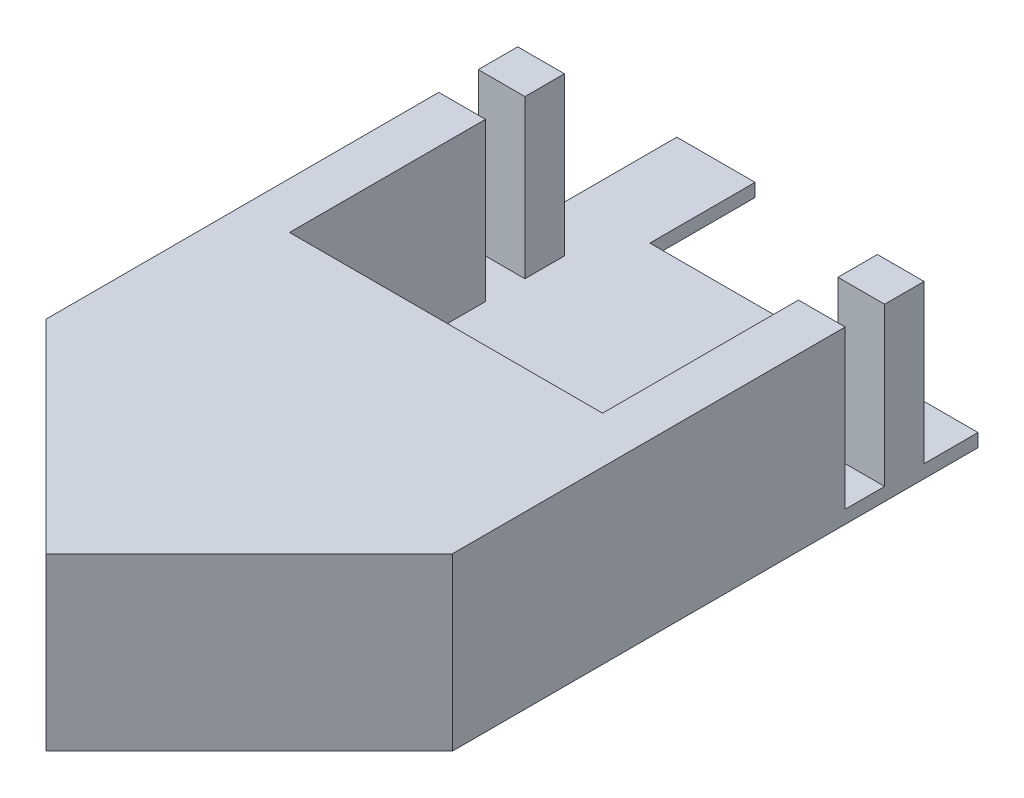
ISO-10303-21;
HEADER;
FILE_DESCRIPTION(('STEP AP214'),'2;1');
FILE_NAME('part.step','',(''),(''),'','','');
FILE_SCHEMA(('AUTOMOTIVE_DESIGN { 1 0 10303 214 1 1 1 1 }'));
ENDSEC;
DATA;
#1=APPLICATION_CONTEXT('core data for automotive mechanical design processes');
#2=APPLICATION_PROTOCOL_DEFINITION('international standard','automotive_design',2000,#1);
#3=PRODUCT_CONTEXT('',#1,'mechanical');
#4=PRODUCT('Part','Part','',(#3));
#5=PRODUCT_RELATED_PRODUCT_CATEGORY('part','',(#4));
#6=PRODUCT_DEFINITION_FORMATION('','',#4);
#7=PRODUCT_DEFINITION_CONTEXT('part definition',#1,'design');
#8=PRODUCT_DEFINITION('design','',#6,#7);
#9=PRODUCT_DEFINITION_SHAPE('','',#8);
#10=(LENGTH_UNIT() NAMED_UNIT(*) SI_UNIT(.MILLI.,.METRE.));
#11=(NAMED_UNIT(*) PLANE_ANGLE_UNIT() SI_UNIT($,.RADIAN.));
#12=(NAMED_UNIT(*) SI_UNIT($,.STERADIAN.) SOLID_ANGLE_UNIT());
#13=UNCERTAINTY_MEASURE_WITH_UNIT(LENGTH_MEASURE(1.E-05),#10,'distance_accuracy_value','');
#14=(GEOMETRIC_REPRESENTATION_CONTEXT(3) GLOBAL_UNCERTAINTY_ASSIGNED_CONTEXT((#13)) GLOBAL_UNIT_ASSIGNED_CONTEXT((#10,
#11,#12)) REPRESENTATION_CONTEXT('',''));
#15=CARTESIAN_POINT('',(0.,0.,0.));
#16=DIRECTION('',(0.,0.,1.));
#17=DIRECTION('',(1.,0.,0.));
#18=AXIS2_PLACEMENT_3D('',#15,#16,#17);
#19=CARTESIAN_POINT('',(0.,-13.1177892367924,0.));
#20=DIRECTION('',(0.,1.,0.));
#21=DIRECTION('',(0.,0.,1.));
#22=AXIS2_PLACEMENT_3D('',#19,#20,#21);
#23=PLANE('',#22);
#24=DIRECTION('',(0.,0.,1.));
#25=VECTOR('',#24,1.);
#26=CARTESIAN_POINT('',(86.384314575051,-13.1177892367924,0.));
#27=LINE('',#26,#25);
#28=CARTESIAN_POINT('',(86.384314575051,-13.1177892367924,-75.9843145750497));
#29=VERTEX_POINT('',#28);
#30=CARTESIAN_POINT('',(86.384314575051,-13.1177892367924,-71.8843145750497));
#31=VERTEX_POINT('',#30);
#32=EDGE_CURVE('E207',#29,#31,#27,.T.);
#33=ORIENTED_EDGE('',*,*,#32,.F.);
#34=DIRECTION('',(-1.,0.,0.));
#35=VECTOR('',#34,1.);
#36=CARTESIAN_POINT('',(0.,-13.1177892367924,-75.9843145750497));
#37=LINE('',#36,#35);
#38=CARTESIAN_POINT('',(61.434314575053,-13.1177892367924,-75.9843145750497));
#39=VERTEX_POINT('',#38);
#40=EDGE_CURVE('E199',#29,#39,#37,.T.);
#41=ORIENTED_EDGE('',*,*,#40,.T.);
#42=DIRECTION('',(0.,0.,-1.));
#43=VECTOR('',#42,1.);
#44=CARTESIAN_POINT('',(61.434314575053,-13.1177892367924,0.));
#45=LINE('',#44,#43);
#46=CARTESIAN_POINT('',(61.434314575053,-13.1177892367924,-83.9843145750501));
#47=VERTEX_POINT('',#46);
#48=EDGE_CURVE('E186',#39,#47,#45,.T.);
#49=ORIENTED_EDGE('',*,*,#48,.T.);
#50=DIRECTION('',(1.,0.,0.));
#51=VECTOR('',#50,1.);
#52=CARTESIAN_POINT('',(-5.43153318923716E-12,-13.1177892367924,-83.9843145750461));
#53=LINE('',#52,#51);
#54=CARTESIAN_POINT('',(55.4843145750486,-13.1177892367924,-83.9843145750497));
#55=VERTEX_POINT('',#54);
#56=EDGE_CURVE('E198',#55,#47,#53,.T.);
#57=ORIENTED_EDGE('',*,*,#56,.F.);
#58=DIRECTION('',(0.,0.,1.));
#59=VECTOR('',#58,1.);
#60=CARTESIAN_POINT('',(55.4843145750486,-13.1177892367924,0.));
#61=LINE('',#60,#59);
#62=CARTESIAN_POINT('',(55.4843145750486,-13.1177892367924,-71.8843145750497));
#63=VERTEX_POINT('',#62);
#64=EDGE_CURVE('E211',#55,#63,#61,.T.);
#65=ORIENTED_EDGE('',*,*,#64,.T.);
#66=DIRECTION('',(-1.,0.,0.));
#67=VECTOR('',#66,1.);
#68=CARTESIAN_POINT('',(0.,-13.1177892367924,-71.8843145750497));
#69=LINE('',#68,#67);
#70=CARTESIAN_POINT('',(59.0343145750498,-13.1177892367924,-71.8843145750497));
#71=VERTEX_POINT('',#70);
#72=EDGE_CURVE('E391',#71,#63,#69,.T.);
#73=ORIENTED_EDGE('',*,*,#72,.F.);
#74=DIRECTION('',(0.,0.,-1.));
#75=VECTOR('',#74,1.);
#76=CARTESIAN_POINT('',(59.0343145750498,-13.1177892367924,0.));
#77=LINE('',#76,#75);
#78=CARTESIAN_POINT('',(59.0343145750498,-13.1177892367924,-68.8843145750497));
#79=VERTEX_POINT('',#78);
#80=EDGE_CURVE('E64',#79,#71,#77,.T.);
#81=ORIENTED_EDGE('',*,*,#80,.F.);
#82=DIRECTION('',(1.,0.,0.));
#83=VECTOR('',#82,1.);
#84=CARTESIAN_POINT('',(0.,-13.1177892367924,-68.8843145750497));
#85=LINE('',#84,#83);
#86=CARTESIAN_POINT('',(55.4843145750486,-13.1177892367924,-68.8843145750497));
#87=VERTEX_POINT('',#86);
#88=EDGE_CURVE('E360',#87,#79,#85,.T.);
#89=ORIENTED_EDGE('',*,*,#88,.F.);
#90=CARTESIAN_POINT('',(55.4843145750486,-13.1177892367924,-65.8843145750497));
#91=VERTEX_POINT('',#90);
#92=EDGE_CURVE('E206',#87,#91,#61,.T.);
#93=ORIENTED_EDGE('',*,*,#92,.T.);
#94=DIRECTION('',(-1.,0.,0.));
#95=VECTOR('',#94,1.);
#96=CARTESIAN_POINT('',(0.,-13.1177892367924,-65.8843145750497));
#97=LINE('',#96,#95);
#98=CARTESIAN_POINT('',(59.0343145750498,-13.1177892367924,-65.8843145750497));
#99=VERTEX_POINT('',#98);
#100=EDGE_CURVE('E305',#99,#91,#97,.T.);
#101=ORIENTED_EDGE('',*,*,#100,.F.);
#102=DIRECTION('',(0.,0.,-1.));
#103=VECTOR('',#102,1.);
#104=CARTESIAN_POINT('',(59.0343145750498,-13.1177892367924,0.));
#105=LINE('',#104,#103);
#106=CARTESIAN_POINT('',(59.0343145750498,-13.1177892367924,-50.9843145750497));
#107=VERTEX_POINT('',#106);
#108=EDGE_CURVE('E309',#107,#99,#105,.T.);
#109=ORIENTED_EDGE('',*,*,#108,.F.);
#110=DIRECTION('',(-1.,0.,0.));
#111=VECTOR('',#110,1.);
#112=CARTESIAN_POINT('',(0.,-13.1177892367924,-50.9843145750497));
#113=LINE('',#112,#111);
#114=CARTESIAN_POINT('',(82.8343145750498,-13.1177892367924,-50.9843145750497));
#115=VERTEX_POINT('',#114);
#116=EDGE_CURVE('E312',#115,#107,#113,.T.);
#117=ORIENTED_EDGE('',*,*,#116,.F.);
#118=DIRECTION('',(0.,0.,1.));
#119=VECTOR('',#118,1.);
#120=CARTESIAN_POINT('',(82.8343145750498,-13.1177892367924,0.));
#121=LINE('',#120,#119);
#122=CARTESIAN_POINT('',(82.8343145750498,-13.1177892367924,-65.8843145750497));
#123=VERTEX_POINT('',#122);
#124=EDGE_CURVE('E315',#123,#115,#121,.T.);
#125=ORIENTED_EDGE('',*,*,#124,.F.);
#126=DIRECTION('',(-1.,0.,0.));
#127=VECTOR('',#126,1.);
#128=CARTESIAN_POINT('',(0.,-13.1177892367924,-65.8843145750497));
#129=LINE('',#128,#127);
#130=CARTESIAN_POINT('',(86.384314575051,-13.1177892367924,-65.8843145750497));
#131=VERTEX_POINT('',#130);
#132=EDGE_CURVE('E223',#131,#123,#129,.T.);
#133=ORIENTED_EDGE('',*,*,#132,.F.);
#134=CARTESIAN_POINT('',(86.384314575051,-13.1177892367924,-68.8843145750497));
#135=VERTEX_POINT('',#134);
#136=EDGE_CURVE('E213',#135,#131,#27,.T.);
#137=ORIENTED_EDGE('',*,*,#136,.F.);
#138=DIRECTION('',(-1.,0.,0.));
#139=VECTOR('',#138,1.);
#140=CARTESIAN_POINT('',(0.,-13.1177892367924,-68.8843145750497));
#141=LINE('',#140,#139);
#142=CARTESIAN_POINT('',(82.8343145750498,-13.1177892367924,-68.8843145750497));
#143=VERTEX_POINT('',#142);
#144=EDGE_CURVE('E430',#135,#143,#141,.T.);
#145=ORIENTED_EDGE('',*,*,#144,.T.);
#146=DIRECTION('',(0.,0.,-1.));
#147=VECTOR('',#146,1.);
#148=CARTESIAN_POINT('',(82.8343145750498,-13.1177892367924,0.));
#149=LINE('',#148,#147);
#150=CARTESIAN_POINT('',(82.8343145750498,-13.1177892367924,-71.8843145750497));
#151=VERTEX_POINT('',#150);
#152=EDGE_CURVE('E434',#143,#151,#149,.T.);
#153=ORIENTED_EDGE('',*,*,#152,.T.);
#154=DIRECTION('',(1.,0.,0.));
#155=VECTOR('',#154,1.);
#156=CARTESIAN_POINT('',(0.,-13.1177892367924,-71.8843145750497));
#157=LINE('',#156,#155);
#158=EDGE_CURVE('E426',#151,#31,#157,.T.);
#159=ORIENTED_EDGE('',*,*,#158,.T.);
#160=EDGE_LOOP('',(#33,#41,#49,#57,#65,#73,#81,#89,#93,#101,#109,#117,#125,#133,#137,#145,#153,#159));
#161=FACE_BOUND('',#160,.T.);
#162=ADVANCED_FACE('F41',(#161),#23,.T.);
#163=CARTESIAN_POINT('',(86.384314575051,-13.1177892367924,0.));
#164=DIRECTION('',(1.,0.,0.));
#165=DIRECTION('',(0.,0.,-1.));
#166=AXIS2_PLACEMENT_3D('',#163,#164,#165);
#167=PLANE('',#166);
#168=DIRECTION('',(0.,0.,1.));
#169=VECTOR('',#168,1.);
#170=CARTESIAN_POINT('',(86.384314575051,-14.1177892367924,0.));
#171=LINE('',#170,#169);
#172=CARTESIAN_POINT('',(86.384314575051,-14.1177892367924,-75.9843145750497));
#173=VERTEX_POINT('',#172);
#174=CARTESIAN_POINT('',(86.384314575051,-14.1177892367924,-36.0156854249524));
#175=VERTEX_POINT('',#174);
#176=EDGE_CURVE('E219',#173,#175,#171,.T.);
#177=ORIENTED_EDGE('',*,*,#176,.F.);
#178=DIRECTION('',(0.,-1.,0.));
#179=VECTOR('',#178,1.);
#180=CARTESIAN_POINT('',(86.384314575051,19.4077915204273,-75.9843145750497));
#181=LINE('',#180,#179);
#182=EDGE_CURVE('E193',#29,#173,#181,.T.);
#183=ORIENTED_EDGE('',*,*,#182,.F.);
#184=ORIENTED_EDGE('',*,*,#32,.T.);
#185=DIRECTION('',(0.,-1.,0.));
#186=VECTOR('',#185,1.);
#187=CARTESIAN_POINT('',(86.384314575051,-1.11778923679241,-71.8843145750497));
#188=LINE('',#187,#186);
#189=CARTESIAN_POINT('',(86.384314575051,-1.11778923679241,-71.8843145750497));
#190=VERTEX_POINT('',#189);
#191=EDGE_CURVE('E414',#190,#31,#188,.T.);
#192=ORIENTED_EDGE('',*,*,#191,.F.);
#193=DIRECTION('',(0.,0.,1.));
#194=VECTOR('',#193,1.);
#195=CARTESIAN_POINT('',(86.384314575051,-1.11778923679241,0.));
#196=LINE('',#195,#194);
#197=CARTESIAN_POINT('',(86.384314575051,-1.11778923679241,-68.8843145750497));
#198=VERTEX_POINT('',#197);
#199=EDGE_CURVE('E403',#190,#198,#196,.T.);
#200=ORIENTED_EDGE('',*,*,#199,.T.);
#201=DIRECTION('',(0.,-1.,0.));
#202=VECTOR('',#201,1.);
#203=CARTESIAN_POINT('',(86.384314575051,-1.11778923679241,-68.8843145750497));
#204=LINE('',#203,#202);
#205=EDGE_CURVE('E418',#198,#135,#204,.T.);
#206=ORIENTED_EDGE('',*,*,#205,.T.);
#207=ORIENTED_EDGE('',*,*,#136,.T.);
#208=DIRECTION('',(0.,-1.,0.));
#209=VECTOR('',#208,1.);
#210=CARTESIAN_POINT('',(86.384314575051,-1.11778923679241,-65.8843145750497));
#211=LINE('',#210,#209);
#212=CARTESIAN_POINT('',(86.384314575051,-1.11778923679241,-65.8843145750497));
#213=VERTEX_POINT('',#212);
#214=EDGE_CURVE('E276',#213,#131,#211,.T.);
#215=ORIENTED_EDGE('',*,*,#214,.F.);
#216=DIRECTION('',(0.,0.,1.));
#217=VECTOR('',#216,1.);
#218=CARTESIAN_POINT('',(86.384314575051,-1.11778923679241,0.));
#219=LINE('',#218,#217);
#220=CARTESIAN_POINT('',(86.384314575051,-1.11778923679241,-36.0156854249524));
#221=VERTEX_POINT('',#220);
#222=EDGE_CURVE('E271',#213,#221,#219,.T.);
#223=ORIENTED_EDGE('',*,*,#222,.T.);
#224=DIRECTION('',(0.,-1.,0.));
#225=VECTOR('',#224,1.);
#226=CARTESIAN_POINT('',(86.384314575051,-13.1177892367924,-36.0156854249524));
#227=LINE('',#226,#225);
#228=EDGE_CURVE('E218',#221,#175,#227,.T.);
#229=ORIENTED_EDGE('',*,*,#228,.T.);
#230=EDGE_LOOP('',(#177,#183,#184,#192,#200,#206,#207,#215,#223,#229));
#231=FACE_BOUND('',#230,.T.);
#232=ADVANCED_FACE('F43',(#231),#167,.T.);
#233=CARTESIAN_POINT('',(-5.43153318923716E-12,-13.1177892367924,-83.9843145750461));
#234=DIRECTION('',(0.,0.,-1.));
#235=DIRECTION('',(-1.,0.,0.));
#236=AXIS2_PLACEMENT_3D('',#233,#234,#235);
#237=PLANE('',#236);
#238=ORIENTED_EDGE('',*,*,#56,.T.);
#239=DIRECTION('',(0.,-1.,0.));
#240=VECTOR('',#239,1.);
#241=CARTESIAN_POINT('',(61.434314575053,19.4077915204273,-83.9843145750501));
#242=LINE('',#241,#240);
#243=CARTESIAN_POINT('',(61.434314575053,-14.1177892367924,-83.9843145750501));
#244=VERTEX_POINT('',#243);
#245=EDGE_CURVE('E183',#47,#244,#242,.T.);
#246=ORIENTED_EDGE('',*,*,#245,.T.);
#247=DIRECTION('',(1.,0.,0.));
#248=VECTOR('',#247,1.);
#249=CARTESIAN_POINT('',(-5.43153318923716E-12,-14.1177892367924,-83.9843145750461));
#250=LINE('',#249,#248);
#251=CARTESIAN_POINT('',(55.4843145750486,-14.1177892367924,-83.9843145750497));
#252=VERTEX_POINT('',#251);
#253=EDGE_CURVE('E222',#252,#244,#250,.T.);
#254=ORIENTED_EDGE('',*,*,#253,.F.);
#255=DIRECTION('',(0.,-1.,0.));
#256=VECTOR('',#255,1.);
#257=CARTESIAN_POINT('',(55.4843145750486,-13.1177892367924,-83.9843145750497));
#258=LINE('',#257,#256);
#259=EDGE_CURVE('E203',#55,#252,#258,.T.);
#260=ORIENTED_EDGE('',*,*,#259,.F.);
#261=EDGE_LOOP('',(#238,#246,#254,#260));
#262=FACE_BOUND('',#261,.T.);
#263=ADVANCED_FACE('F202',(#262),#237,.T.);
#264=CARTESIAN_POINT('',(0.,-14.1177892367924,0.));
#265=DIRECTION('',(0.,1.,0.));
#266=DIRECTION('',(0.,0.,1.));
#267=AXIS2_PLACEMENT_3D('',#264,#265,#266);
#268=PLANE('',#267);
#269=DIRECTION('',(-1.,0.,0.));
#270=VECTOR('',#269,1.);
#271=CARTESIAN_POINT('',(0.,-14.1177892367924,-75.9843145750497));
#272=LINE('',#271,#270);
#273=CARTESIAN_POINT('',(61.434314575053,-14.1177892367924,-75.9843145750497));
#274=VERTEX_POINT('',#273);
#275=EDGE_CURVE('E11',#173,#274,#272,.T.);
#276=ORIENTED_EDGE('',*,*,#275,.F.);
#277=ORIENTED_EDGE('',*,*,#176,.T.);
#278=DIRECTION('',(0.707106781186547,0.,-0.707106781186548));
#279=VECTOR('',#278,1.);
#280=CARTESIAN_POINT('',(25.1843145750493,-14.1177892367924,25.1843145750493));
#281=LINE('',#280,#279);
#282=CARTESIAN_POINT('',(70.9343145750498,-14.1177892367924,-20.5656854249512));
#283=VERTEX_POINT('',#282);
#284=EDGE_CURVE('E232',#283,#175,#281,.T.);
#285=ORIENTED_EDGE('',*,*,#284,.F.);
#286=DIRECTION('',(0.707106781186547,0.,0.707106781186548));
#287=VECTOR('',#286,1.);
#288=CARTESIAN_POINT('',(45.7500000000005,-14.1177892367924,-45.7500000000005));
#289=LINE('',#288,#287);
#290=CARTESIAN_POINT('',(55.4843145750486,-14.1177892367924,-36.0156854249524));
#291=VERTEX_POINT('',#290);
#292=EDGE_CURVE('E229',#291,#283,#289,.T.);
#293=ORIENTED_EDGE('',*,*,#292,.F.);
#294=DIRECTION('',(0.,0.,1.));
#295=VECTOR('',#294,1.);
#296=CARTESIAN_POINT('',(55.4843145750486,-14.1177892367924,0.));
#297=LINE('',#296,#295);
#298=EDGE_CURVE('E226',#252,#291,#297,.T.);
#299=ORIENTED_EDGE('',*,*,#298,.F.);
#300=ORIENTED_EDGE('',*,*,#253,.T.);
#301=DIRECTION('',(0.,0.,-1.));
#302=VECTOR('',#301,1.);
#303=CARTESIAN_POINT('',(61.434314575053,-14.1177892367924,0.));
#304=LINE('',#303,#302);
#305=EDGE_CURVE('E50',#274,#244,#304,.T.);
#306=ORIENTED_EDGE('',*,*,#305,.F.);
#307=EDGE_LOOP('',(#276,#277,#285,#293,#299,#300,#306));
#308=FACE_BOUND('',#307,.T.);
#309=ADVANCED_FACE('F256',(#308),#268,.F.);
#310=CARTESIAN_POINT('',(55.4843145750486,-13.1177892367924,0.));
#311=DIRECTION('',(1.,0.,0.));
#312=DIRECTION('',(0.,0.,-1.));
#313=AXIS2_PLACEMENT_3D('',#310,#311,#312);
#314=PLANE('',#313);
#315=ORIENTED_EDGE('',*,*,#298,.T.);
#316=DIRECTION('',(0.,-1.,0.));
#317=VECTOR('',#316,1.);
#318=CARTESIAN_POINT('',(55.4843145750486,-13.1177892367924,-36.0156854249524));
#319=LINE('',#318,#317);
#320=CARTESIAN_POINT('',(55.4843145750486,-1.11778923679241,-36.0156854249524));
#321=VERTEX_POINT('',#320);
#322=EDGE_CURVE('E243',#321,#291,#319,.T.);
#323=ORIENTED_EDGE('',*,*,#322,.F.);
#324=DIRECTION('',(0.,0.,1.));
#325=VECTOR('',#324,1.);
#326=CARTESIAN_POINT('',(55.4843145750486,-1.11778923679241,0.));
#327=LINE('',#326,#325);
#328=CARTESIAN_POINT('',(55.4843145750486,-1.11778923679241,-65.8843145750497));
#329=VERTEX_POINT('',#328);
#330=EDGE_CURVE('E278',#329,#321,#327,.T.);
#331=ORIENTED_EDGE('',*,*,#330,.F.);
#332=DIRECTION('',(0.,-1.,0.));
#333=VECTOR('',#332,1.);
#334=CARTESIAN_POINT('',(55.4843145750486,-1.11778923679241,-65.8843145750497));
#335=LINE('',#334,#333);
#336=EDGE_CURVE('E285',#329,#91,#335,.T.);
#337=ORIENTED_EDGE('',*,*,#336,.T.);
#338=ORIENTED_EDGE('',*,*,#92,.F.);
#339=DIRECTION('',(0.,-1.,0.));
#340=VECTOR('',#339,1.);
#341=CARTESIAN_POINT('',(55.4843145750486,-1.11778923679241,-68.8843145750497));
#342=LINE('',#341,#340);
#343=CARTESIAN_POINT('',(55.4843145750486,-1.11778923679241,-68.8843145750497));
#344=VERTEX_POINT('',#343);
#345=EDGE_CURVE('E368',#344,#87,#342,.T.);
#346=ORIENTED_EDGE('',*,*,#345,.F.);
#347=DIRECTION('',(0.,0.,1.));
#348=VECTOR('',#347,1.);
#349=CARTESIAN_POINT('',(55.4843145750486,-1.11778923679241,0.));
#350=LINE('',#349,#348);
#351=CARTESIAN_POINT('',(55.4843145750486,-1.11778923679241,-71.8843145750497));
#352=VERTEX_POINT('',#351);
#353=EDGE_CURVE('E375',#352,#344,#350,.T.);
#354=ORIENTED_EDGE('',*,*,#353,.F.);
#355=DIRECTION('',(0.,-1.,0.));
#356=VECTOR('',#355,1.);
#357=CARTESIAN_POINT('',(55.4843145750486,-1.11778923679241,-71.8843145750497));
#358=LINE('',#357,#356);
#359=EDGE_CURVE('E374',#352,#63,#358,.T.);
#360=ORIENTED_EDGE('',*,*,#359,.T.);
#361=ORIENTED_EDGE('',*,*,#64,.F.);
#362=ORIENTED_EDGE('',*,*,#259,.T.);
#363=EDGE_LOOP('',(#315,#323,#331,#337,#338,#346,#354,#360,#361,#362));
#364=FACE_BOUND('',#363,.T.);
#365=ADVANCED_FACE('F251',(#364),#314,.F.);
#366=CARTESIAN_POINT('',(45.7500000000005,-13.1177892367924,-45.7500000000005));
#367=DIRECTION('',(0.707106781186548,0.,-0.707106781186547));
#368=DIRECTION('',(-0.707106781186547,0.,-0.707106781186548));
#369=AXIS2_PLACEMENT_3D('',#366,#367,#368);
#370=PLANE('',#369);
#371=ORIENTED_EDGE('',*,*,#292,.T.);
#372=DIRECTION('',(0.,-1.,0.));
#373=VECTOR('',#372,1.);
#374=CARTESIAN_POINT('',(70.9343145750498,-13.1177892367924,-20.5656854249512));
#375=LINE('',#374,#373);
#376=CARTESIAN_POINT('',(70.9343145750498,-1.11778923679241,-20.5656854249512));
#377=VERTEX_POINT('',#376);
#378=EDGE_CURVE('E239',#377,#283,#375,.T.);
#379=ORIENTED_EDGE('',*,*,#378,.F.);
#380=DIRECTION('',(0.707106781186547,0.,0.707106781186548));
#381=VECTOR('',#380,1.);
#382=CARTESIAN_POINT('',(45.7500000000005,-1.11778923679241,-45.7500000000005));
#383=LINE('',#382,#381);
#384=EDGE_CURVE('E272',#321,#377,#383,.T.);
#385=ORIENTED_EDGE('',*,*,#384,.F.);
#386=ORIENTED_EDGE('',*,*,#322,.T.);
#387=EDGE_LOOP('',(#371,#379,#385,#386));
#388=FACE_BOUND('',#387,.T.);
#389=ADVANCED_FACE('F259',(#388),#370,.F.);
#390=CARTESIAN_POINT('',(25.1843145750493,-13.1177892367924,25.1843145750493));
#391=DIRECTION('',(-0.707106781186548,0.,-0.707106781186547));
#392=DIRECTION('',(-0.707106781186547,0.,0.707106781186548));
#393=AXIS2_PLACEMENT_3D('',#390,#391,#392);
#394=PLANE('',#393);
#395=ORIENTED_EDGE('',*,*,#284,.T.);
#396=ORIENTED_EDGE('',*,*,#228,.F.);
#397=DIRECTION('',(0.707106781186547,0.,-0.707106781186548));
#398=VECTOR('',#397,1.);
#399=CARTESIAN_POINT('',(25.1843145750493,-1.11778923679241,25.1843145750493));
#400=LINE('',#399,#398);
#401=EDGE_CURVE('E266',#377,#221,#400,.T.);
#402=ORIENTED_EDGE('',*,*,#401,.F.);
#403=ORIENTED_EDGE('',*,*,#378,.T.);
#404=EDGE_LOOP('',(#395,#396,#402,#403));
#405=FACE_BOUND('',#404,.T.);
#406=ADVANCED_FACE('F264',(#405),#394,.F.);
#407=CARTESIAN_POINT('',(0.,-1.11778923679241,-65.8843145750497));
#408=DIRECTION('',(0.,0.,-1.));
#409=DIRECTION('',(-1.,0.,0.));
#410=AXIS2_PLACEMENT_3D('',#407,#408,#409);
#411=PLANE('',#410);
#412=ORIENTED_EDGE('',*,*,#214,.T.);
#413=ORIENTED_EDGE('',*,*,#132,.T.);
#414=DIRECTION('',(0.,-1.,0.));
#415=VECTOR('',#414,1.);
#416=CARTESIAN_POINT('',(82.8343145750498,-1.11778923679241,-65.8843145750497));
#417=LINE('',#416,#415);
#418=CARTESIAN_POINT('',(82.8343145750498,-1.11778923679241,-65.8843145750497));
#419=VERTEX_POINT('',#418);
#420=EDGE_CURVE('E301',#419,#123,#417,.T.);
#421=ORIENTED_EDGE('',*,*,#420,.F.);
#422=DIRECTION('',(1.,0.,0.));
#423=VECTOR('',#422,1.);
#424=CARTESIAN_POINT('',(0.,-1.11778923679241,-65.8843145750497));
#425=LINE('',#424,#423);
#426=EDGE_CURVE('E438',#419,#213,#425,.T.);
#427=ORIENTED_EDGE('',*,*,#426,.T.);
#428=EDGE_LOOP('',(#412,#413,#421,#427));
#429=FACE_BOUND('',#428,.T.);
#430=ADVANCED_FACE('F320',(#429),#411,.T.);
#431=CARTESIAN_POINT('',(82.8343145750498,-1.11778923679241,0.));
#432=DIRECTION('',(-1.,0.,0.));
#433=DIRECTION('',(0.,0.,1.));
#434=AXIS2_PLACEMENT_3D('',#431,#432,#433);
#435=PLANE('',#434);
#436=ORIENTED_EDGE('',*,*,#420,.T.);
#437=ORIENTED_EDGE('',*,*,#124,.T.);
#438=DIRECTION('',(0.,-1.,0.));
#439=VECTOR('',#438,1.);
#440=CARTESIAN_POINT('',(82.8343145750498,-1.11778923679241,-50.9843145750497));
#441=LINE('',#440,#439);
#442=CARTESIAN_POINT('',(82.8343145750498,-1.11778923679241,-50.9843145750497));
#443=VERTEX_POINT('',#442);
#444=EDGE_CURVE('E297',#443,#115,#441,.T.);
#445=ORIENTED_EDGE('',*,*,#444,.F.);
#446=DIRECTION('',(0.,0.,-1.));
#447=VECTOR('',#446,1.);
#448=CARTESIAN_POINT('',(82.8343145750498,-1.11778923679241,0.));
#449=LINE('',#448,#447);
#450=EDGE_CURVE('E329',#443,#419,#449,.T.);
#451=ORIENTED_EDGE('',*,*,#450,.T.);
#452=EDGE_LOOP('',(#436,#437,#445,#451));
#453=FACE_BOUND('',#452,.T.);
#454=ADVANCED_FACE('F327',(#453),#435,.T.);
#455=CARTESIAN_POINT('',(0.,-1.11778923679241,-50.9843145750497));
#456=DIRECTION('',(0.,0.,-1.));
#457=DIRECTION('',(-1.,0.,0.));
#458=AXIS2_PLACEMENT_3D('',#455,#456,#457);
#459=PLANE('',#458);
#460=ORIENTED_EDGE('',*,*,#444,.T.);
#461=ORIENTED_EDGE('',*,*,#116,.T.);
#462=DIRECTION('',(0.,-1.,0.));
#463=VECTOR('',#462,1.);
#464=CARTESIAN_POINT('',(59.0343145750498,-1.11778923679241,-50.9843145750497));
#465=LINE('',#464,#463);
#466=CARTESIAN_POINT('',(59.0343145750498,-1.11778923679241,-50.9843145750497));
#467=VERTEX_POINT('',#466);
#468=EDGE_CURVE('E293',#467,#107,#465,.T.);
#469=ORIENTED_EDGE('',*,*,#468,.F.);
#470=DIRECTION('',(1.,0.,0.));
#471=VECTOR('',#470,1.);
#472=CARTESIAN_POINT('',(0.,-1.11778923679241,-50.9843145750497));
#473=LINE('',#472,#471);
#474=EDGE_CURVE('E346',#467,#443,#473,.T.);
#475=ORIENTED_EDGE('',*,*,#474,.T.);
#476=EDGE_LOOP('',(#460,#461,#469,#475));
#477=FACE_BOUND('',#476,.T.);
#478=ADVANCED_FACE('F334',(#477),#459,.T.);
#479=CARTESIAN_POINT('',(59.0343145750498,-1.11778923679241,0.));
#480=DIRECTION('',(1.,0.,0.));
#481=DIRECTION('',(0.,0.,-1.));
#482=AXIS2_PLACEMENT_3D('',#479,#480,#481);
#483=PLANE('',#482);
#484=ORIENTED_EDGE('',*,*,#468,.T.);
#485=ORIENTED_EDGE('',*,*,#108,.T.);
#486=DIRECTION('',(0.,-1.,0.));
#487=VECTOR('',#486,1.);
#488=CARTESIAN_POINT('',(59.0343145750498,-1.11778923679241,-65.8843145750497));
#489=LINE('',#488,#487);
#490=CARTESIAN_POINT('',(59.0343145750498,-1.11778923679241,-65.8843145750497));
#491=VERTEX_POINT('',#490);
#492=EDGE_CURVE('E289',#491,#99,#489,.T.);
#493=ORIENTED_EDGE('',*,*,#492,.F.);
#494=DIRECTION('',(0.,0.,1.));
#495=VECTOR('',#494,1.);
#496=CARTESIAN_POINT('',(59.0343145750498,-1.11778923679241,0.));
#497=LINE('',#496,#495);
#498=EDGE_CURVE('E341',#491,#467,#497,.T.);
#499=ORIENTED_EDGE('',*,*,#498,.T.);
#500=EDGE_LOOP('',(#484,#485,#493,#499));
#501=FACE_BOUND('',#500,.T.);
#502=ADVANCED_FACE('F339',(#501),#483,.T.);
#503=CARTESIAN_POINT('',(0.,-1.11778923679241,-65.8843145750497));
#504=DIRECTION('',(0.,0.,-1.));
#505=DIRECTION('',(-1.,0.,0.));
#506=AXIS2_PLACEMENT_3D('',#503,#504,#505);
#507=PLANE('',#506);
#508=ORIENTED_EDGE('',*,*,#492,.T.);
#509=ORIENTED_EDGE('',*,*,#100,.T.);
#510=ORIENTED_EDGE('',*,*,#336,.F.);
#511=DIRECTION('',(1.,0.,0.));
#512=VECTOR('',#511,1.);
#513=CARTESIAN_POINT('',(0.,-1.11778923679241,-65.8843145750497));
#514=LINE('',#513,#512);
#515=EDGE_CURVE('E345',#329,#491,#514,.T.);
#516=ORIENTED_EDGE('',*,*,#515,.T.);
#517=EDGE_LOOP('',(#508,#509,#510,#516));
#518=FACE_BOUND('',#517,.T.);
#519=ADVANCED_FACE('F359',(#518),#507,.T.);
#520=CARTESIAN_POINT('',(0.,-1.11778923679241,0.));
#521=DIRECTION('',(0.,1.,0.));
#522=DIRECTION('',(0.,0.,1.));
#523=AXIS2_PLACEMENT_3D('',#520,#521,#522);
#524=PLANE('',#523);
#525=ORIENTED_EDGE('',*,*,#426,.F.);
#526=ORIENTED_EDGE('',*,*,#450,.F.);
#527=ORIENTED_EDGE('',*,*,#474,.F.);
#528=ORIENTED_EDGE('',*,*,#498,.F.);
#529=ORIENTED_EDGE('',*,*,#515,.F.);
#530=ORIENTED_EDGE('',*,*,#330,.T.);
#531=ORIENTED_EDGE('',*,*,#384,.T.);
#532=ORIENTED_EDGE('',*,*,#401,.T.);
#533=ORIENTED_EDGE('',*,*,#222,.F.);
#534=EDGE_LOOP('',(#525,#526,#527,#528,#529,#530,#531,#532,#533));
#535=FACE_BOUND('',#534,.T.);
#536=ADVANCED_FACE('F356',(#535),#524,.T.);
#537=CARTESIAN_POINT('',(82.8343145750498,-1.11778923679241,0.));
#538=DIRECTION('',(1.,0.,0.));
#539=DIRECTION('',(0.,0.,-1.));
#540=AXIS2_PLACEMENT_3D('',#537,#538,#539);
#541=PLANE('',#540);
#542=ORIENTED_EDGE('',*,*,#152,.F.);
#543=DIRECTION('',(0.,-1.,0.));
#544=VECTOR('',#543,1.);
#545=CARTESIAN_POINT('',(82.8343145750498,-1.11778923679241,-68.8843145750497));
#546=LINE('',#545,#544);
#547=CARTESIAN_POINT('',(82.8343145750498,-1.11778923679241,-68.8843145750497));
#548=VERTEX_POINT('',#547);
#549=EDGE_CURVE('E422',#548,#143,#546,.T.);
#550=ORIENTED_EDGE('',*,*,#549,.F.);
#551=DIRECTION('',(0.,0.,1.));
#552=VECTOR('',#551,1.);
#553=CARTESIAN_POINT('',(82.8343145750498,-1.11778923679241,0.));
#554=LINE('',#553,#552);
#555=CARTESIAN_POINT('',(82.8343145750498,-1.11778923679241,-71.8843145750497));
#556=VERTEX_POINT('',#555);
#557=EDGE_CURVE('E365',#556,#548,#554,.T.);
#558=ORIENTED_EDGE('',*,*,#557,.F.);
#559=DIRECTION('',(0.,-1.,0.));
#560=VECTOR('',#559,1.);
#561=CARTESIAN_POINT('',(82.8343145750498,-1.11778923679241,-71.8843145750497));
#562=LINE('',#561,#560);
#563=EDGE_CURVE('E410',#556,#151,#562,.T.);
#564=ORIENTED_EDGE('',*,*,#563,.T.);
#565=EDGE_LOOP('',(#542,#550,#558,#564));
#566=FACE_BOUND('',#565,.T.);
#567=ADVANCED_FACE('F450',(#566),#541,.F.);
#568=CARTESIAN_POINT('',(0.,-1.11778923679241,-68.8843145750497));
#569=DIRECTION('',(0.,0.,-1.));
#570=DIRECTION('',(-1.,0.,0.));
#571=AXIS2_PLACEMENT_3D('',#568,#569,#570);
#572=PLANE('',#571);
#573=ORIENTED_EDGE('',*,*,#144,.F.);
#574=ORIENTED_EDGE('',*,*,#205,.F.);
#575=DIRECTION('',(1.,0.,0.));
#576=VECTOR('',#575,1.);
#577=CARTESIAN_POINT('',(0.,-1.11778923679241,-68.8843145750497));
#578=LINE('',#577,#576);
#579=EDGE_CURVE('E400',#548,#198,#578,.T.);
#580=ORIENTED_EDGE('',*,*,#579,.F.);
#581=ORIENTED_EDGE('',*,*,#549,.T.);
#582=EDGE_LOOP('',(#573,#574,#580,#581));
#583=FACE_BOUND('',#582,.T.);
#584=ADVANCED_FACE('F446',(#583),#572,.F.);
#585=CARTESIAN_POINT('',(0.,-1.11778923679241,-71.8843145750497));
#586=DIRECTION('',(0.,0.,1.));
#587=DIRECTION('',(1.,0.,0.));
#588=AXIS2_PLACEMENT_3D('',#585,#586,#587);
#589=PLANE('',#588);
#590=ORIENTED_EDGE('',*,*,#158,.F.);
#591=ORIENTED_EDGE('',*,*,#563,.F.);
#592=DIRECTION('',(-1.,0.,0.));
#593=VECTOR('',#592,1.);
#594=CARTESIAN_POINT('',(0.,-1.11778923679241,-71.8843145750497));
#595=LINE('',#594,#593);
#596=EDGE_CURVE('E407',#190,#556,#595,.T.);
#597=ORIENTED_EDGE('',*,*,#596,.F.);
#598=ORIENTED_EDGE('',*,*,#191,.T.);
#599=EDGE_LOOP('',(#590,#591,#597,#598));
#600=FACE_BOUND('',#599,.T.);
#601=ADVANCED_FACE('F454',(#600),#589,.F.);
#602=CARTESIAN_POINT('',(0.,-1.11778923679241,0.));
#603=DIRECTION('',(0.,1.,0.));
#604=DIRECTION('',(0.,0.,1.));
#605=AXIS2_PLACEMENT_3D('',#602,#603,#604);
#606=PLANE('',#605);
#607=ORIENTED_EDGE('',*,*,#557,.T.);
#608=ORIENTED_EDGE('',*,*,#579,.T.);
#609=ORIENTED_EDGE('',*,*,#199,.F.);
#610=ORIENTED_EDGE('',*,*,#596,.T.);
#611=EDGE_LOOP('',(#607,#608,#609,#610));
#612=FACE_BOUND('',#611,.T.);
#613=ADVANCED_FACE('F487',(#612),#606,.T.);
#614=CARTESIAN_POINT('',(0.,-1.11778923679241,-68.8843145750497));
#615=DIRECTION('',(0.,0.,1.));
#616=DIRECTION('',(1.,0.,0.));
#617=AXIS2_PLACEMENT_3D('',#614,#615,#616);
#618=PLANE('',#617);
#619=ORIENTED_EDGE('',*,*,#345,.T.);
#620=ORIENTED_EDGE('',*,*,#88,.T.);
#621=DIRECTION('',(0.,-1.,0.));
#622=VECTOR('',#621,1.);
#623=CARTESIAN_POINT('',(59.0343145750498,-1.11778923679241,-68.8843145750497));
#624=LINE('',#623,#622);
#625=CARTESIAN_POINT('',(59.0343145750498,-1.11778923679241,-68.8843145750497));
#626=VERTEX_POINT('',#625);
#627=EDGE_CURVE('E388',#626,#79,#624,.T.);
#628=ORIENTED_EDGE('',*,*,#627,.F.);
#629=DIRECTION('',(-1.,0.,0.));
#630=VECTOR('',#629,1.);
#631=CARTESIAN_POINT('',(0.,-1.11778923679241,-68.8843145750497));
#632=LINE('',#631,#630);
#633=EDGE_CURVE('E371',#626,#344,#632,.T.);
#634=ORIENTED_EDGE('',*,*,#633,.T.);
#635=EDGE_LOOP('',(#619,#620,#628,#634));
#636=FACE_BOUND('',#635,.T.);
#637=ADVANCED_FACE('F369',(#636),#618,.T.);
#638=CARTESIAN_POINT('',(59.0343145750498,-1.11778923679241,0.));
#639=DIRECTION('',(1.,0.,0.));
#640=DIRECTION('',(0.,0.,-1.));
#641=AXIS2_PLACEMENT_3D('',#638,#639,#640);
#642=PLANE('',#641);
#643=ORIENTED_EDGE('',*,*,#627,.T.);
#644=ORIENTED_EDGE('',*,*,#80,.T.);
#645=DIRECTION('',(0.,-1.,0.));
#646=VECTOR('',#645,1.);
#647=CARTESIAN_POINT('',(59.0343145750498,-1.11778923679241,-71.8843145750497));
#648=LINE('',#647,#646);
#649=CARTESIAN_POINT('',(59.0343145750498,-1.11778923679241,-71.8843145750497));
#650=VERTEX_POINT('',#649);
#651=EDGE_CURVE('E379',#650,#71,#648,.T.);
#652=ORIENTED_EDGE('',*,*,#651,.F.);
#653=DIRECTION('',(0.,0.,1.));
#654=VECTOR('',#653,1.);
#655=CARTESIAN_POINT('',(59.0343145750498,-1.11778923679241,0.));
#656=LINE('',#655,#654);
#657=EDGE_CURVE('E467',#650,#626,#656,.T.);
#658=ORIENTED_EDGE('',*,*,#657,.T.);
#659=EDGE_LOOP('',(#643,#644,#652,#658));
#660=FACE_BOUND('',#659,.T.);
#661=ADVANCED_FACE('F479',(#660),#642,.T.);
#662=CARTESIAN_POINT('',(0.,-1.11778923679241,-71.8843145750497));
#663=DIRECTION('',(0.,0.,-1.));
#664=DIRECTION('',(-1.,0.,0.));
#665=AXIS2_PLACEMENT_3D('',#662,#663,#664);
#666=PLANE('',#665);
#667=ORIENTED_EDGE('',*,*,#651,.T.);
#668=ORIENTED_EDGE('',*,*,#72,.T.);
#669=ORIENTED_EDGE('',*,*,#359,.F.);
#670=DIRECTION('',(1.,0.,0.));
#671=VECTOR('',#670,1.);
#672=CARTESIAN_POINT('',(0.,-1.11778923679241,-71.8843145750497));
#673=LINE('',#672,#671);
#674=EDGE_CURVE('E381',#352,#650,#673,.T.);
#675=ORIENTED_EDGE('',*,*,#674,.T.);
#676=EDGE_LOOP('',(#667,#668,#669,#675));
#677=FACE_BOUND('',#676,.T.);
#678=ADVANCED_FACE('F474',(#677),#666,.T.);
#679=CARTESIAN_POINT('',(0.,-1.11778923679241,0.));
#680=DIRECTION('',(0.,1.,0.));
#681=DIRECTION('',(0.,0.,1.));
#682=AXIS2_PLACEMENT_3D('',#679,#680,#681);
#683=PLANE('',#682);
#684=ORIENTED_EDGE('',*,*,#633,.F.);
#685=ORIENTED_EDGE('',*,*,#657,.F.);
#686=ORIENTED_EDGE('',*,*,#674,.F.);
#687=ORIENTED_EDGE('',*,*,#353,.T.);
#688=EDGE_LOOP('',(#684,#685,#686,#687));
#689=FACE_BOUND('',#688,.T.);
#690=ADVANCED_FACE('F477',(#689),#683,.T.);
#691=CARTESIAN_POINT('',(0.,19.4077915204273,-75.9843145750497));
#692=DIRECTION('',(0.,0.,-1.));
#693=DIRECTION('',(-1.,0.,0.));
#694=AXIS2_PLACEMENT_3D('',#691,#692,#693);
#695=PLANE('',#694);
#696=ORIENTED_EDGE('',*,*,#182,.T.);
#697=ORIENTED_EDGE('',*,*,#275,.T.);
#698=DIRECTION('',(0.,-1.,0.));
#699=VECTOR('',#698,1.);
#700=CARTESIAN_POINT('',(61.434314575053,19.4077915204273,-75.9843145750497));
#701=LINE('',#700,#699);
#702=EDGE_CURVE('E57',#39,#274,#701,.T.);
#703=ORIENTED_EDGE('',*,*,#702,.F.);
#704=ORIENTED_EDGE('',*,*,#40,.F.);
#705=EDGE_LOOP('',(#696,#697,#703,#704));
#706=FACE_BOUND('',#705,.T.);
#707=ADVANCED_FACE('F626',(#706),#695,.T.);
#708=CARTESIAN_POINT('',(61.434314575053,19.4077915204273,0.));
#709=DIRECTION('',(1.,0.,0.));
#710=DIRECTION('',(0.,0.,-1.));
#711=AXIS2_PLACEMENT_3D('',#708,#709,#710);
#712=PLANE('',#711);
#713=ORIENTED_EDGE('',*,*,#702,.T.);
#714=ORIENTED_EDGE('',*,*,#305,.T.);
#715=ORIENTED_EDGE('',*,*,#245,.F.);
#716=ORIENTED_EDGE('',*,*,#48,.F.);
#717=EDGE_LOOP('',(#713,#714,#715,#716));
#718=FACE_BOUND('',#717,.T.);
#719=ADVANCED_FACE('F185',(#718),#712,.T.);
#720=CLOSED_SHELL('',(#162,#232,#263,#309,#365,#389,#406,#430,#454,#478,#502,#519,#536,#567,
#584,#601,#613,#637,#661,#678,#690,#707,#719));
#721=MANIFOLD_SOLID_BREP('B2',#720);
#722=ADVANCED_BREP_SHAPE_REPRESENTATION('',(#18,#721),#14);
#723=SHAPE_DEFINITION_REPRESENTATION(#9,#722);
ENDSEC;
END-ISO-10303-21;
